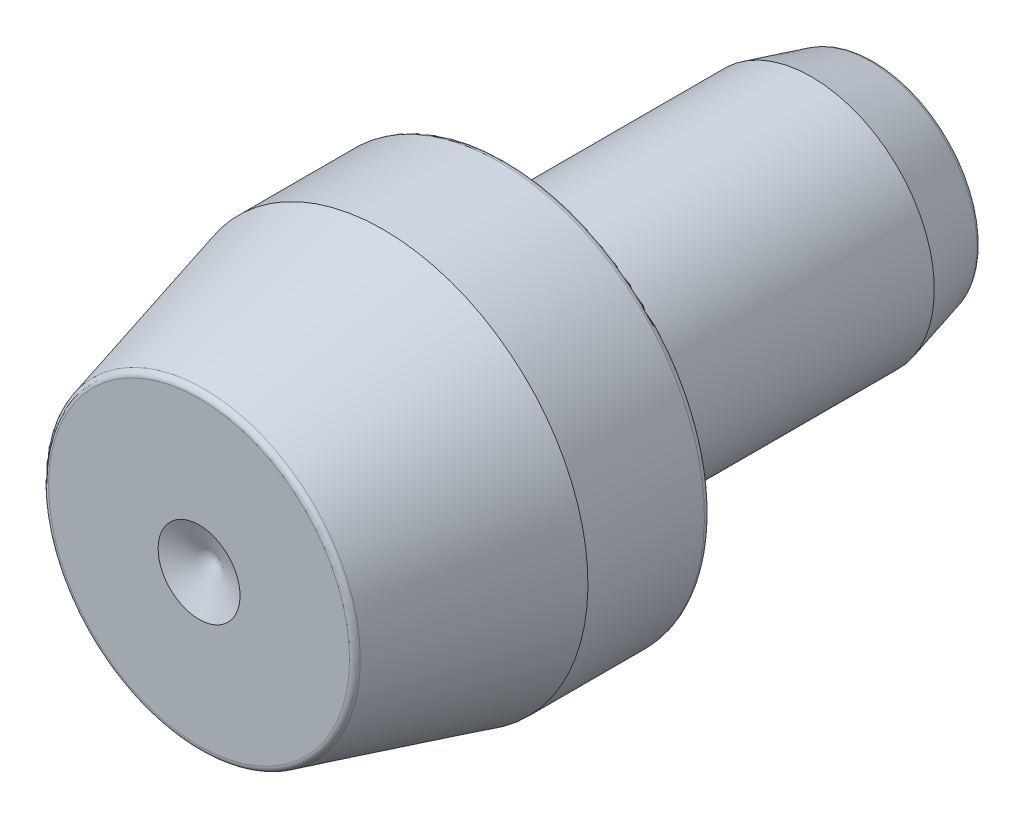
ISO-10303-21;
HEADER;
FILE_DESCRIPTION(('STEP AP214'),'2;1');
FILE_NAME('part.step','',(''),(''),'','','');
FILE_SCHEMA(('AUTOMOTIVE_DESIGN { 1 0 10303 214 1 1 1 1 }'));
ENDSEC;
DATA;
#1=APPLICATION_CONTEXT('core data for automotive mechanical design processes');
#2=APPLICATION_PROTOCOL_DEFINITION('international standard','automotive_design',2000,#1);
#3=PRODUCT_CONTEXT('',#1,'mechanical');
#4=PRODUCT('Part','Part','',(#3));
#5=PRODUCT_RELATED_PRODUCT_CATEGORY('part','',(#4));
#6=PRODUCT_DEFINITION_FORMATION('','',#4);
#7=PRODUCT_DEFINITION_CONTEXT('part definition',#1,'design');
#8=PRODUCT_DEFINITION('design','',#6,#7);
#9=PRODUCT_DEFINITION_SHAPE('','',#8);
#10=(LENGTH_UNIT() NAMED_UNIT(*) SI_UNIT(.MILLI.,.METRE.));
#11=(NAMED_UNIT(*) PLANE_ANGLE_UNIT() SI_UNIT($,.RADIAN.));
#12=(NAMED_UNIT(*) SI_UNIT($,.STERADIAN.) SOLID_ANGLE_UNIT());
#13=UNCERTAINTY_MEASURE_WITH_UNIT(LENGTH_MEASURE(1.E-05),#10,'distance_accuracy_value','');
#14=(GEOMETRIC_REPRESENTATION_CONTEXT(3) GLOBAL_UNCERTAINTY_ASSIGNED_CONTEXT((#13)) GLOBAL_UNIT_ASSIGNED_CONTEXT((#10,
#11,#12)) REPRESENTATION_CONTEXT('',''));
#15=CARTESIAN_POINT('',(0.,0.,0.));
#16=DIRECTION('',(0.,0.,1.));
#17=DIRECTION('',(1.,0.,0.));
#18=AXIS2_PLACEMENT_3D('',#15,#16,#17);
#19=CARTESIAN_POINT('',(0.,0.,16.5000000000001));
#20=DIRECTION('',(0.,0.,1.));
#21=DIRECTION('',(0.,-1.,0.));
#22=AXIS2_PLACEMENT_3D('',#19,#20,#21);
#23=CONICAL_SURFACE('',#22,2.,1.17809724509618);
#24=CARTESIAN_POINT('',(0.,0.,15.6715728752539));
#25=VERTEX_POINT('',#24);
#26=VERTEX_LOOP('',#25);
#27=FACE_BOUND('',#26,.T.);
#28=CARTESIAN_POINT('',(0.,0.,16.5000000000001));
#29=DIRECTION('',(0.,0.,-1.));
#30=DIRECTION('',(0.,1.,0.));
#31=AXIS2_PLACEMENT_3D('',#28,#29,#30);
#32=CIRCLE('',#31,2.);
#33=CARTESIAN_POINT('',(0.,1.99999999999993,16.5000000000001));
#34=VERTEX_POINT('',#33);
#35=EDGE_CURVE('E12',#34,#34,#32,.T.);
#36=ORIENTED_EDGE('',*,*,#35,.F.);
#37=EDGE_LOOP('',(#36));
#38=FACE_BOUND('',#37,.T.);
#39=ADVANCED_FACE('F191',(#27,#38),#23,.F.);
#40=CARTESIAN_POINT('',(0.,1.99999999999999,16.5000000000001));
#41=DIRECTION('',(0.,0.,1.));
#42=DIRECTION('',(0.,-1.,0.));
#43=AXIS2_PLACEMENT_3D('',#40,#41,#42);
#44=PLANE('',#43);
#45=ORIENTED_EDGE('',*,*,#35,.T.);
#46=EDGE_LOOP('',(#45));
#47=FACE_BOUND('',#46,.T.);
#48=CARTESIAN_POINT('',(0.,0.,16.5000000000001));
#49=DIRECTION('',(0.,0.,-1.));
#50=DIRECTION('',(0.,1.,0.));
#51=AXIS2_PLACEMENT_3D('',#48,#49,#50);
#52=CIRCLE('',#51,7.35250421931636);
#53=CARTESIAN_POINT('',(0.,7.35250421931629,16.5000000000001));
#54=VERTEX_POINT('',#53);
#55=EDGE_CURVE('E197',#54,#54,#52,.T.);
#56=ORIENTED_EDGE('',*,*,#55,.F.);
#57=EDGE_LOOP('',(#56));
#58=FACE_BOUND('',#57,.T.);
#59=ADVANCED_FACE('F202',(#47,#58),#44,.T.);
#60=CARTESIAN_POINT('',(0.,0.,16.1925000000001));
#61=DIRECTION('',(0.,0.,-1.));
#62=DIRECTION('',(0.,1.,0.));
#63=AXIS2_PLACEMENT_3D('',#60,#61,#62);
#64=TOROIDAL_SURFACE('',#63,7.35250421931636,0.307499999999999);
#65=ORIENTED_EDGE('',*,*,#55,.T.);
#66=EDGE_LOOP('',(#65));
#67=FACE_BOUND('',#66,.T.);
#68=CARTESIAN_POINT('',(0.,0.,16.2720868563691));
#69=DIRECTION('',(0.,0.,-1.));
#70=DIRECTION('',(0.,1.,0.));
#71=AXIS2_PLACEMENT_3D('',#68,#69,#70);
#72=CIRCLE('',#71,7.64952641090025);
#73=CARTESIAN_POINT('',(0.,7.64952641090018,16.2720868563691));
#74=VERTEX_POINT('',#73);
#75=EDGE_CURVE('E211',#74,#74,#72,.T.);
#76=ORIENTED_EDGE('',*,*,#75,.F.);
#77=EDGE_LOOP('',(#76));
#78=FACE_BOUND('',#77,.T.);
#79=ADVANCED_FACE('F207',(#67,#78),#64,.T.);
#80=CARTESIAN_POINT('',(0.,0.,7.50000000000001));
#81=DIRECTION('',(0.,0.,-1.));
#82=DIRECTION('',(0.,1.,0.));
#83=AXIS2_PLACEMENT_3D('',#80,#81,#82);
#84=CONICAL_SURFACE('',#83,10.,0.26179938779915);
#85=ORIENTED_EDGE('',*,*,#75,.T.);
#86=EDGE_LOOP('',(#85));
#87=FACE_BOUND('',#86,.T.);
#88=CARTESIAN_POINT('',(0.,0.,7.50000000000001));
#89=DIRECTION('',(0.,0.,-1.));
#90=DIRECTION('',(0.,1.,0.));
#91=AXIS2_PLACEMENT_3D('',#88,#89,#90);
#92=CIRCLE('',#91,10.);
#93=CARTESIAN_POINT('',(0.,10.,7.50000000000001));
#94=VERTEX_POINT('',#93);
#95=EDGE_CURVE('E213',#94,#94,#92,.T.);
#96=ORIENTED_EDGE('',*,*,#95,.F.);
#97=EDGE_LOOP('',(#96));
#98=FACE_BOUND('',#97,.T.);
#99=ADVANCED_FACE('F302',(#87,#98),#84,.T.);
#100=CARTESIAN_POINT('',(0.,0.,-16.5));
#101=DIRECTION('',(0.,0.,-1.));
#102=DIRECTION('',(0.,1.,0.));
#103=AXIS2_PLACEMENT_3D('',#100,#101,#102);
#104=CYLINDRICAL_SURFACE('',#103,10.);
#105=ORIENTED_EDGE('',*,*,#95,.T.);
#106=EDGE_LOOP('',(#105));
#107=FACE_BOUND('',#106,.T.);
#108=CARTESIAN_POINT('',(0.,0.,1.80750000000002));
#109=DIRECTION('',(0.,0.,-1.));
#110=DIRECTION('',(0.,1.,0.));
#111=AXIS2_PLACEMENT_3D('',#108,#109,#110);
#112=CIRCLE('',#111,10.);
#113=CARTESIAN_POINT('',(0.,10.,1.80750000000002));
#114=VERTEX_POINT('',#113);
#115=EDGE_CURVE('E218',#114,#114,#112,.T.);
#116=ORIENTED_EDGE('',*,*,#115,.F.);
#117=EDGE_LOOP('',(#116));
#118=FACE_BOUND('',#117,.T.);
#119=ADVANCED_FACE('F298',(#107,#118),#104,.T.);
#120=CARTESIAN_POINT('',(0.,0.,1.80750000000002));
#121=DIRECTION('',(0.,0.,-1.));
#122=DIRECTION('',(0.,1.,0.));
#123=AXIS2_PLACEMENT_3D('',#120,#121,#122);
#124=TOROIDAL_SURFACE('',#123,9.6925,0.307499999999999);
#125=ORIENTED_EDGE('',*,*,#115,.T.);
#126=EDGE_LOOP('',(#125));
#127=FACE_BOUND('',#126,.T.);
#128=CARTESIAN_POINT('',(0.,0.,1.5));
#129=DIRECTION('',(0.,0.,-1.));
#130=DIRECTION('',(0.,1.,0.));
#131=AXIS2_PLACEMENT_3D('',#128,#129,#130);
#132=CIRCLE('',#131,9.6925);
#133=CARTESIAN_POINT('',(0.,9.6925,1.5));
#134=VERTEX_POINT('',#133);
#135=EDGE_CURVE('E221',#134,#134,#132,.T.);
#136=ORIENTED_EDGE('',*,*,#135,.F.);
#137=EDGE_LOOP('',(#136));
#138=FACE_BOUND('',#137,.T.);
#139=ADVANCED_FACE('F294',(#127,#138),#124,.T.);
#140=CARTESIAN_POINT('',(0.,9.69249999999998,1.5));
#141=DIRECTION('',(0.,0.,-1.));
#142=DIRECTION('',(0.,1.,0.));
#143=AXIS2_PLACEMENT_3D('',#140,#141,#142);
#144=PLANE('',#143);
#145=ORIENTED_EDGE('',*,*,#135,.T.);
#146=EDGE_LOOP('',(#145));
#147=FACE_BOUND('',#146,.T.);
#148=CARTESIAN_POINT('',(0.,0.,1.5));
#149=DIRECTION('',(0.,0.,-1.));
#150=DIRECTION('',(0.,1.,0.));
#151=AXIS2_PLACEMENT_3D('',#148,#149,#150);
#152=CIRCLE('',#151,6.9225);
#153=CARTESIAN_POINT('',(0.,6.9225,1.5));
#154=VERTEX_POINT('',#153);
#155=EDGE_CURVE('E224',#154,#154,#152,.T.);
#156=ORIENTED_EDGE('',*,*,#155,.F.);
#157=EDGE_LOOP('',(#156));
#158=FACE_BOUND('',#157,.T.);
#159=ADVANCED_FACE('F290',(#147,#158),#144,.T.);
#160=CARTESIAN_POINT('',(0.,0.,1.5));
#161=DIRECTION('',(0.,0.,-1.));
#162=DIRECTION('',(0.,1.,0.));
#163=AXIS2_PLACEMENT_3D('',#160,#161,#162);
#164=TOROIDAL_SURFACE('',#163,6.615,0.307500000000003);
#165=ORIENTED_EDGE('',*,*,#155,.T.);
#166=EDGE_LOOP('',(#165));
#167=FACE_BOUND('',#166,.T.);
#168=CARTESIAN_POINT('',(0.,0.,1.80750000000002));
#169=DIRECTION('',(0.,0.,-1.));
#170=DIRECTION('',(0.,1.,0.));
#171=AXIS2_PLACEMENT_3D('',#168,#169,#170);
#172=CIRCLE('',#171,6.615);
#173=CARTESIAN_POINT('',(0.,6.615,1.80750000000002));
#174=VERTEX_POINT('',#173);
#175=EDGE_CURVE('E227',#174,#174,#172,.T.);
#176=ORIENTED_EDGE('',*,*,#175,.F.);
#177=EDGE_LOOP('',(#176));
#178=FACE_BOUND('',#177,.T.);
#179=ADVANCED_FACE('F286',(#167,#178),#164,.F.);
#180=CARTESIAN_POINT('',(0.,6.61499999999997,1.80749999999996));
#181=DIRECTION('',(0.,0.,-1.));
#182=DIRECTION('',(0.,1.,0.));
#183=AXIS2_PLACEMENT_3D('',#180,#181,#182);
#184=PLANE('',#183);
#185=ORIENTED_EDGE('',*,*,#175,.T.);
#186=EDGE_LOOP('',(#185));
#187=FACE_BOUND('',#186,.T.);
#188=CARTESIAN_POINT('',(0.,0.,1.80750000000002));
#189=DIRECTION('',(0.,0.,-1.));
#190=DIRECTION('',(0.,1.,0.));
#191=AXIS2_PLACEMENT_3D('',#188,#189,#190);
#192=CIRCLE('',#191,6.);
#193=CARTESIAN_POINT('',(0.,6.00000000000001,1.80750000000002));
#194=VERTEX_POINT('',#193);
#195=EDGE_CURVE('E230',#194,#194,#192,.T.);
#196=ORIENTED_EDGE('',*,*,#195,.F.);
#197=EDGE_LOOP('',(#196));
#198=FACE_BOUND('',#197,.T.);
#199=ADVANCED_FACE('F282',(#187,#198),#184,.T.);
#200=CARTESIAN_POINT('',(0.,0.,1.5));
#201=DIRECTION('',(0.,0.,-1.));
#202=DIRECTION('',(0.,1.,0.));
#203=AXIS2_PLACEMENT_3D('',#200,#201,#202);
#204=TOROIDAL_SURFACE('',#203,6.,0.3075);
#205=ORIENTED_EDGE('',*,*,#195,.T.);
#206=EDGE_LOOP('',(#205));
#207=FACE_BOUND('',#206,.T.);
#208=CARTESIAN_POINT('',(0.,0.,1.5));
#209=DIRECTION('',(0.,0.,-1.));
#210=DIRECTION('',(0.,1.,0.));
#211=AXIS2_PLACEMENT_3D('',#208,#209,#210);
#212=CIRCLE('',#211,5.6925);
#213=CARTESIAN_POINT('',(0.,5.69250000000001,1.5));
#214=VERTEX_POINT('',#213);
#215=EDGE_CURVE('E233',#214,#214,#212,.T.);
#216=ORIENTED_EDGE('',*,*,#215,.F.);
#217=EDGE_LOOP('',(#216));
#218=FACE_BOUND('',#217,.T.);
#219=ADVANCED_FACE('F278',(#207,#218),#204,.F.);
#220=CARTESIAN_POINT('',(0.,0.,-16.5));
#221=DIRECTION('',(0.,0.,-1.));
#222=DIRECTION('',(0.,1.,0.));
#223=AXIS2_PLACEMENT_3D('',#220,#221,#222);
#224=CYLINDRICAL_SURFACE('',#223,5.6925);
#225=ORIENTED_EDGE('',*,*,#215,.T.);
#226=EDGE_LOOP('',(#225));
#227=FACE_BOUND('',#226,.T.);
#228=CARTESIAN_POINT('',(0.,0.,-0.0375000000000236));
#229=DIRECTION('',(0.,0.,-1.));
#230=DIRECTION('',(0.,1.,0.));
#231=AXIS2_PLACEMENT_3D('',#228,#229,#230);
#232=CIRCLE('',#231,5.6925);
#233=CARTESIAN_POINT('',(0.,5.69250000000001,-0.0375000000000231));
#234=VERTEX_POINT('',#233);
#235=EDGE_CURVE('E236',#234,#234,#232,.T.);
#236=ORIENTED_EDGE('',*,*,#235,.F.);
#237=EDGE_LOOP('',(#236));
#238=FACE_BOUND('',#237,.T.);
#239=ADVANCED_FACE('F274',(#227,#238),#224,.T.);
#240=CARTESIAN_POINT('',(0.,0.,-0.344999999999984));
#241=DIRECTION('',(0.,0.,-1.));
#242=DIRECTION('',(0.,1.,0.));
#243=AXIS2_PLACEMENT_3D('',#240,#241,#242);
#244=CONICAL_SURFACE('',#243,6.,0.78539816339745);
#245=ORIENTED_EDGE('',*,*,#235,.T.);
#246=EDGE_LOOP('',(#245));
#247=FACE_BOUND('',#246,.T.);
#248=CARTESIAN_POINT('',(0.,0.,-0.344999999999984));
#249=DIRECTION('',(0.,0.,-1.));
#250=DIRECTION('',(0.,1.,0.));
#251=AXIS2_PLACEMENT_3D('',#248,#249,#250);
#252=CIRCLE('',#251,6.);
#253=CARTESIAN_POINT('',(0.,6.,-0.344999999999984));
#254=VERTEX_POINT('',#253);
#255=EDGE_CURVE('E239',#254,#254,#252,.T.);
#256=ORIENTED_EDGE('',*,*,#255,.F.);
#257=EDGE_LOOP('',(#256));
#258=FACE_BOUND('',#257,.T.);
#259=ADVANCED_FACE('F270',(#247,#258),#244,.T.);
#260=CARTESIAN_POINT('',(0.,0.,-16.5));
#261=DIRECTION('',(0.,0.,-1.));
#262=DIRECTION('',(0.,1.,0.));
#263=AXIS2_PLACEMENT_3D('',#260,#261,#262);
#264=CYLINDRICAL_SURFACE('',#263,6.);
#265=ORIENTED_EDGE('',*,*,#255,.T.);
#266=EDGE_LOOP('',(#265));
#267=FACE_BOUND('',#266,.T.);
#268=CARTESIAN_POINT('',(0.,0.,-13.425));
#269=DIRECTION('',(0.,0.,-1.));
#270=DIRECTION('',(0.,1.,0.));
#271=AXIS2_PLACEMENT_3D('',#268,#269,#270);
#272=CIRCLE('',#271,6.);
#273=CARTESIAN_POINT('',(0.,6.,-13.425));
#274=VERTEX_POINT('',#273);
#275=EDGE_CURVE('E242',#274,#274,#272,.T.);
#276=ORIENTED_EDGE('',*,*,#275,.F.);
#277=EDGE_LOOP('',(#276));
#278=FACE_BOUND('',#277,.T.);
#279=ADVANCED_FACE('F264',(#267,#278),#264,.T.);
#280=CARTESIAN_POINT('',(0.,0.,-16.2720868563691));
#281=DIRECTION('',(0.,0.,1.));
#282=DIRECTION('',(0.,-1.,0.));
#283=AXIS2_PLACEMENT_3D('',#280,#281,#282);
#284=CONICAL_SURFACE('',#283,5.23712537605465,0.261799387799151);
#285=ORIENTED_EDGE('',*,*,#275,.T.);
#286=EDGE_LOOP('',(#285));
#287=FACE_BOUND('',#286,.T.);
#288=CARTESIAN_POINT('',(0.,0.,-16.2720868563691));
#289=DIRECTION('',(0.,0.,-1.));
#290=DIRECTION('',(0.,1.,0.));
#291=AXIS2_PLACEMENT_3D('',#288,#289,#290);
#292=CIRCLE('',#291,5.23712537605465);
#293=CARTESIAN_POINT('',(0.,5.23712537605465,-16.2720868563691));
#294=VERTEX_POINT('',#293);
#295=EDGE_CURVE('E245',#294,#294,#292,.T.);
#296=ORIENTED_EDGE('',*,*,#295,.F.);
#297=EDGE_LOOP('',(#296));
#298=FACE_BOUND('',#297,.T.);
#299=ADVANCED_FACE('F256',(#287,#298),#284,.T.);
#300=CARTESIAN_POINT('',(0.,0.,-16.1925));
#301=DIRECTION('',(0.,0.,-1.));
#302=DIRECTION('',(0.,1.,0.));
#303=AXIS2_PLACEMENT_3D('',#300,#301,#302);
#304=TOROIDAL_SURFACE('',#303,4.94010318447076,0.307499999999999);
#305=ORIENTED_EDGE('',*,*,#295,.T.);
#306=EDGE_LOOP('',(#305));
#307=FACE_BOUND('',#306,.T.);
#308=CARTESIAN_POINT('',(0.,0.,-16.5));
#309=DIRECTION('',(0.,0.,-1.));
#310=DIRECTION('',(0.,1.,0.));
#311=AXIS2_PLACEMENT_3D('',#308,#309,#310);
#312=CIRCLE('',#311,4.94010318447076);
#313=CARTESIAN_POINT('',(0.,4.94010318447077,-16.5));
#314=VERTEX_POINT('',#313);
#315=EDGE_CURVE('E248',#314,#314,#312,.T.);
#316=ORIENTED_EDGE('',*,*,#315,.F.);
#317=EDGE_LOOP('',(#316));
#318=FACE_BOUND('',#317,.T.);
#319=ADVANCED_FACE('F254',(#307,#318),#304,.T.);
#320=CARTESIAN_POINT('',(0.,4.94010318447073,-16.5));
#321=DIRECTION('',(0.,0.,-1.));
#322=DIRECTION('',(0.,1.,0.));
#323=AXIS2_PLACEMENT_3D('',#320,#321,#322);
#324=PLANE('',#323);
#325=ORIENTED_EDGE('',*,*,#315,.T.);
#326=EDGE_LOOP('',(#325));
#327=FACE_BOUND('',#326,.T.);
#328=ADVANCED_FACE('F252',(#327),#324,.T.);
#329=CLOSED_SHELL('',(#39,#59,#79,#99,#119,#139,#159,#179,#199,#219,#239,#259,#279,#299,#319,#328));
#330=MANIFOLD_SOLID_BREP('B2',#329);
#331=ADVANCED_BREP_SHAPE_REPRESENTATION('',(#18,#330),#14);
#332=SHAPE_DEFINITION_REPRESENTATION(#9,#331);
ENDSEC;
END-ISO-10303-21;
